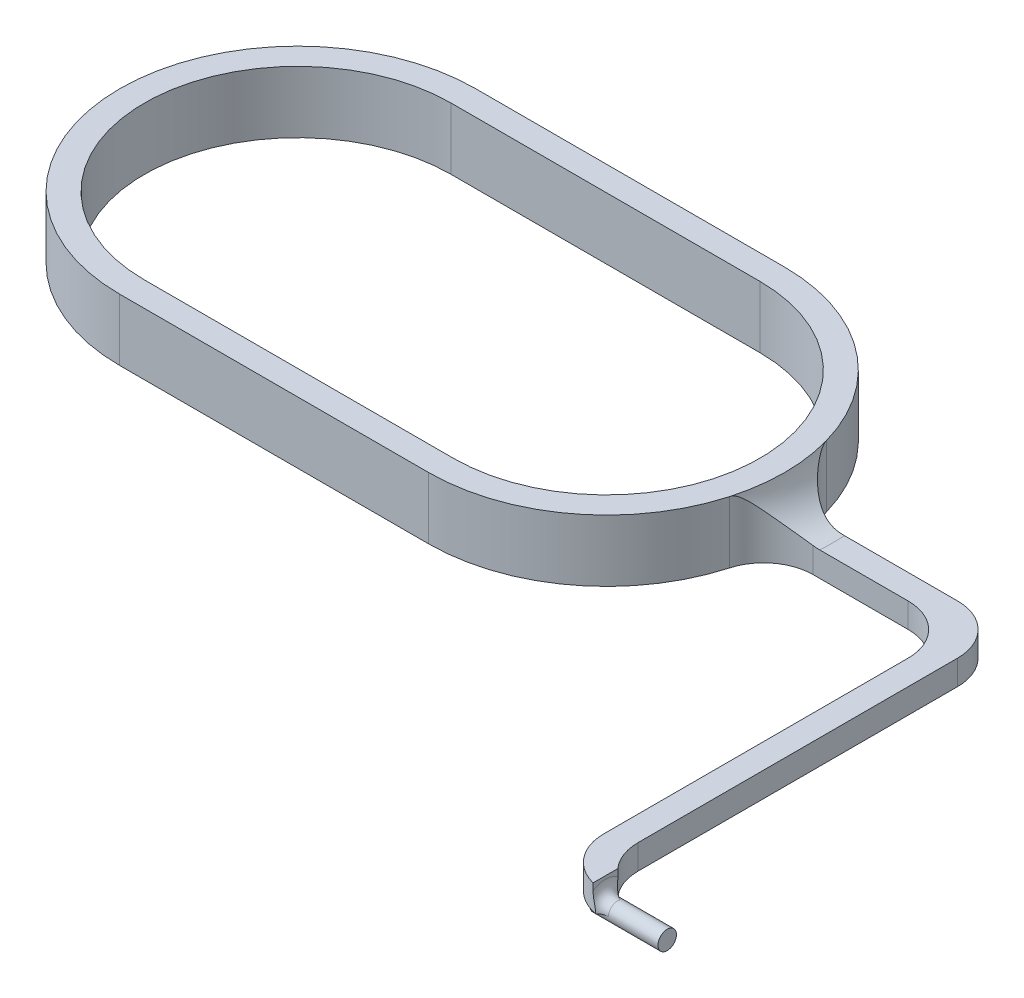
ISO-10303-21;
HEADER;
FILE_DESCRIPTION(('STEP AP214'),'2;1');
FILE_NAME('part.step','',(''),(''),'','','');
FILE_SCHEMA(('AUTOMOTIVE_DESIGN { 1 0 10303 214 1 1 1 1 }'));
ENDSEC;
DATA;
#1=APPLICATION_CONTEXT('core data for automotive mechanical design processes');
#2=APPLICATION_PROTOCOL_DEFINITION('international standard','automotive_design',2000,#1);
#3=PRODUCT_CONTEXT('',#1,'mechanical');
#4=PRODUCT('Part','Part','',(#3));
#5=PRODUCT_RELATED_PRODUCT_CATEGORY('part','',(#4));
#6=PRODUCT_DEFINITION_FORMATION('','',#4);
#7=PRODUCT_DEFINITION_CONTEXT('part definition',#1,'design');
#8=PRODUCT_DEFINITION('design','',#6,#7);
#9=PRODUCT_DEFINITION_SHAPE('','',#8);
#10=(LENGTH_UNIT() NAMED_UNIT(*) SI_UNIT(.MILLI.,.METRE.));
#11=(NAMED_UNIT(*) PLANE_ANGLE_UNIT() SI_UNIT($,.RADIAN.));
#12=(NAMED_UNIT(*) SI_UNIT($,.STERADIAN.) SOLID_ANGLE_UNIT());
#13=UNCERTAINTY_MEASURE_WITH_UNIT(LENGTH_MEASURE(1.E-05),#10,'distance_accuracy_value','');
#14=(GEOMETRIC_REPRESENTATION_CONTEXT(3) GLOBAL_UNCERTAINTY_ASSIGNED_CONTEXT((#13)) GLOBAL_UNIT_ASSIGNED_CONTEXT((#10,
#11,#12)) REPRESENTATION_CONTEXT('',''));
#15=CARTESIAN_POINT('',(0.,0.,0.));
#16=DIRECTION('',(0.,0.,1.));
#17=DIRECTION('',(1.,0.,0.));
#18=AXIS2_PLACEMENT_3D('',#15,#16,#17);
#19=CARTESIAN_POINT('',(25.,5.,0.));
#20=DIRECTION('',(0.,-1.,0.));
#21=DIRECTION('',(0.,0.,-1.));
#22=AXIS2_PLACEMENT_3D('',#19,#20,#21);
#23=CYLINDRICAL_SURFACE('',#22,14.4);
#24=CARTESIAN_POINT('',(25.,0.,0.));
#25=DIRECTION('',(0.,1.,0.));
#26=DIRECTION('',(0.,0.,1.));
#27=AXIS2_PLACEMENT_3D('',#24,#25,#26);
#28=CIRCLE('',#27,14.4);
#29=CARTESIAN_POINT('',(25.,0.,14.4));
#30=VERTEX_POINT('',#29);
#31=CARTESIAN_POINT('',(38.8581416769075,0.,3.91304347826087));
#32=VERTEX_POINT('',#31);
#33=EDGE_CURVE('E347',#30,#32,#28,.T.);
#34=ORIENTED_EDGE('',*,*,#33,.T.);
#35=DIRECTION('',(0.,-1.,0.));
#36=VECTOR('',#35,1.);
#37=CARTESIAN_POINT('',(38.8581416769075,5.,3.91304347826087));
#38=LINE('',#37,#36);
#39=CARTESIAN_POINT('',(38.8581416769075,5.,3.91304347826087));
#40=VERTEX_POINT('',#39);
#41=EDGE_CURVE('E381',#32,#40,#38,.F.);
#42=ORIENTED_EDGE('',*,*,#41,.T.);
#43=CARTESIAN_POINT('',(25.,5.,0.));
#44=DIRECTION('',(0.,1.,0.));
#45=DIRECTION('',(0.,0.,1.));
#46=AXIS2_PLACEMENT_3D('',#43,#44,#45);
#47=CIRCLE('',#46,14.4);
#48=CARTESIAN_POINT('',(25.,5.,14.4));
#49=VERTEX_POINT('',#48);
#50=EDGE_CURVE('E331',#49,#40,#47,.T.);
#51=ORIENTED_EDGE('',*,*,#50,.F.);
#52=DIRECTION('',(0.,-1.,0.));
#53=VECTOR('',#52,1.);
#54=CARTESIAN_POINT('',(25.,5.,14.4));
#55=LINE('',#54,#53);
#56=EDGE_CURVE('E360',#49,#30,#55,.T.);
#57=ORIENTED_EDGE('',*,*,#56,.T.);
#58=EDGE_LOOP('',(#34,#42,#51,#57));
#59=FACE_BOUND('',#58,.T.);
#60=ADVANCED_FACE('F41',(#59),#23,.T.);
#61=CARTESIAN_POINT('',(0.,5.,0.));
#62=DIRECTION('',(0.,1.,0.));
#63=DIRECTION('',(0.,0.,1.));
#64=AXIS2_PLACEMENT_3D('',#61,#62,#63);
#65=PLANE('',#64);
#66=CARTESIAN_POINT('',(0.,5.,0.));
#67=DIRECTION('',(0.,1.,0.));
#68=DIRECTION('',(0.,0.,1.));
#69=AXIS2_PLACEMENT_3D('',#66,#67,#68);
#70=CIRCLE('',#69,14.4);
#71=CARTESIAN_POINT('',(0.,5.,-14.4));
#72=VERTEX_POINT('',#71);
#73=CARTESIAN_POINT('',(0.,5.,14.4));
#74=VERTEX_POINT('',#73);
#75=EDGE_CURVE('E322',#72,#74,#70,.T.);
#76=ORIENTED_EDGE('',*,*,#75,.T.);
#77=DIRECTION('',(1.,0.,0.));
#78=VECTOR('',#77,1.);
#79=CARTESIAN_POINT('',(0.,5.,14.4));
#80=LINE('',#79,#78);
#81=EDGE_CURVE('E326',#74,#49,#80,.T.);
#82=ORIENTED_EDGE('',*,*,#81,.T.);
#83=ORIENTED_EDGE('',*,*,#50,.T.);
#84=CARTESIAN_POINT('',(38.8581416769075,5.,-3.91304347826087));
#85=VERTEX_POINT('',#84);
#86=EDGE_CURVE('E336',#40,#85,#47,.T.);
#87=ORIENTED_EDGE('',*,*,#86,.T.);
#88=CARTESIAN_POINT('',(25.,5.,-14.4));
#89=VERTEX_POINT('',#88);
#90=EDGE_CURVE('E330',#85,#89,#47,.T.);
#91=ORIENTED_EDGE('',*,*,#90,.T.);
#92=DIRECTION('',(-1.,0.,0.));
#93=VECTOR('',#92,1.);
#94=CARTESIAN_POINT('',(0.,5.,-14.4));
#95=LINE('',#94,#93);
#96=EDGE_CURVE('E335',#89,#72,#95,.T.);
#97=ORIENTED_EDGE('',*,*,#96,.T.);
#98=EDGE_LOOP('',(#76,#82,#83,#87,#91,#97));
#99=FACE_BOUND('',#98,.T.);
#100=DIRECTION('',(1.,0.,0.));
#101=VECTOR('',#100,1.);
#102=CARTESIAN_POINT('',(0.,5.,12.4));
#103=LINE('',#102,#101);
#104=CARTESIAN_POINT('',(0.,5.,12.4));
#105=VERTEX_POINT('',#104);
#106=CARTESIAN_POINT('',(25.,5.,12.4));
#107=VERTEX_POINT('',#106);
#108=EDGE_CURVE('E282',#105,#107,#103,.T.);
#109=ORIENTED_EDGE('',*,*,#108,.F.);
#110=CARTESIAN_POINT('',(0.,5.,0.));
#111=DIRECTION('',(0.,1.,0.));
#112=DIRECTION('',(0.,0.,1.));
#113=AXIS2_PLACEMENT_3D('',#110,#111,#112);
#114=CIRCLE('',#113,12.4);
#115=CARTESIAN_POINT('',(0.,5.,-12.4));
#116=VERTEX_POINT('',#115);
#117=EDGE_CURVE('E279',#116,#105,#114,.T.);
#118=ORIENTED_EDGE('',*,*,#117,.F.);
#119=DIRECTION('',(-1.,0.,0.));
#120=VECTOR('',#119,1.);
#121=CARTESIAN_POINT('',(0.,5.,-12.4));
#122=LINE('',#121,#120);
#123=CARTESIAN_POINT('',(25.,5.,-12.4));
#124=VERTEX_POINT('',#123);
#125=EDGE_CURVE('E290',#124,#116,#122,.T.);
#126=ORIENTED_EDGE('',*,*,#125,.F.);
#127=CARTESIAN_POINT('',(25.,5.,0.));
#128=DIRECTION('',(0.,1.,0.));
#129=DIRECTION('',(0.,0.,1.));
#130=AXIS2_PLACEMENT_3D('',#127,#128,#129);
#131=CIRCLE('',#130,12.4);
#132=EDGE_CURVE('E286',#107,#124,#131,.T.);
#133=ORIENTED_EDGE('',*,*,#132,.F.);
#134=EDGE_LOOP('',(#109,#118,#126,#133));
#135=FACE_BOUND('',#134,.T.);
#136=ADVANCED_FACE('F506',(#99,#135),#65,.T.);
#137=CARTESIAN_POINT('',(0.,0.,0.));
#138=DIRECTION('',(0.,1.,0.));
#139=DIRECTION('',(0.,0.,1.));
#140=AXIS2_PLACEMENT_3D('',#137,#138,#139);
#141=PLANE('',#140);
#142=CARTESIAN_POINT('',(25.,0.,0.));
#143=DIRECTION('',(0.,1.,0.));
#144=DIRECTION('',(0.,0.,1.));
#145=AXIS2_PLACEMENT_3D('',#142,#143,#144);
#146=CIRCLE('',#145,12.4);
#147=CARTESIAN_POINT('',(25.,0.,12.4));
#148=VERTEX_POINT('',#147);
#149=CARTESIAN_POINT('',(25.,0.,-12.4));
#150=VERTEX_POINT('',#149);
#151=EDGE_CURVE('E301',#148,#150,#146,.T.);
#152=ORIENTED_EDGE('',*,*,#151,.T.);
#153=DIRECTION('',(-1.,0.,0.));
#154=VECTOR('',#153,1.);
#155=CARTESIAN_POINT('',(0.,0.,-12.4));
#156=LINE('',#155,#154);
#157=CARTESIAN_POINT('',(0.,0.,-12.4));
#158=VERTEX_POINT('',#157);
#159=EDGE_CURVE('E283',#150,#158,#156,.T.);
#160=ORIENTED_EDGE('',*,*,#159,.T.);
#161=CARTESIAN_POINT('',(0.,0.,0.));
#162=DIRECTION('',(0.,1.,0.));
#163=DIRECTION('',(0.,0.,1.));
#164=AXIS2_PLACEMENT_3D('',#161,#162,#163);
#165=CIRCLE('',#164,12.4);
#166=CARTESIAN_POINT('',(0.,0.,12.4));
#167=VERTEX_POINT('',#166);
#168=EDGE_CURVE('E275',#158,#167,#165,.T.);
#169=ORIENTED_EDGE('',*,*,#168,.T.);
#170=DIRECTION('',(1.,0.,0.));
#171=VECTOR('',#170,1.);
#172=CARTESIAN_POINT('',(0.,0.,12.4));
#173=LINE('',#172,#171);
#174=EDGE_CURVE('E297',#167,#148,#173,.T.);
#175=ORIENTED_EDGE('',*,*,#174,.T.);
#176=EDGE_LOOP('',(#152,#160,#169,#175));
#177=FACE_BOUND('',#176,.T.);
#178=DIRECTION('',(0.,0.,-1.));
#179=VECTOR('',#178,1.);
#180=CARTESIAN_POINT('',(56.9,0.,0.));
#181=LINE('',#180,#179);
#182=CARTESIAN_POINT('',(56.9,0.,33.25));
#183=VERTEX_POINT('',#182);
#184=CARTESIAN_POINT('',(56.9,0.,31.75));
#185=VERTEX_POINT('',#184);
#186=EDGE_CURVE('E209',#183,#185,#181,.T.);
#187=ORIENTED_EDGE('',*,*,#186,.F.);
#188=DIRECTION('',(1.,0.,0.));
#189=VECTOR('',#188,1.);
#190=CARTESIAN_POINT('',(56.9,0.,33.25));
#191=LINE('',#190,#189);
#192=CARTESIAN_POINT('',(58.4,0.,33.25));
#193=VERTEX_POINT('',#192);
#194=EDGE_CURVE('E223',#183,#193,#191,.T.);
#195=ORIENTED_EDGE('',*,*,#194,.T.);
#196=CARTESIAN_POINT('',(58.4,0.,34.25));
#197=DIRECTION('',(0.,1.,0.));
#198=DIRECTION('',(0.,0.,1.));
#199=AXIS2_PLACEMENT_3D('',#196,#197,#198);
#200=CIRCLE('',#199,1.);
#201=CARTESIAN_POINT('',(57.675393330706,0.,33.5608373379131));
#202=VERTEX_POINT('',#201);
#203=EDGE_CURVE('E56',#193,#202,#200,.T.);
#204=ORIENTED_EDGE('',*,*,#203,.T.);
#205=CARTESIAN_POINT('',(58.4,0.,29.6270166537926));
#206=DIRECTION('',(0.,1.,0.));
#207=DIRECTION('',(0.,0.,1.));
#208=AXIS2_PLACEMENT_3D('',#205,#206,#207);
#209=CIRCLE('',#208,4.);
#210=CARTESIAN_POINT('',(54.4,0.,29.6270166537926));
#211=VERTEX_POINT('',#210);
#212=EDGE_CURVE('E70',#202,#211,#209,.F.);
#213=ORIENTED_EDGE('',*,*,#212,.T.);
#214=DIRECTION('',(0.,0.,1.));
#215=VECTOR('',#214,1.);
#216=CARTESIAN_POINT('',(54.4,0.,0.));
#217=LINE('',#216,#215);
#218=CARTESIAN_POINT('',(54.4,0.,5.));
#219=VERTEX_POINT('',#218);
#220=EDGE_CURVE('E256',#219,#211,#217,.T.);
#221=ORIENTED_EDGE('',*,*,#220,.F.);
#222=CARTESIAN_POINT('',(50.4,0.,5.));
#223=DIRECTION('',(0.,1.,0.));
#224=DIRECTION('',(0.,0.,1.));
#225=AXIS2_PLACEMENT_3D('',#222,#223,#224);
#226=CIRCLE('',#225,4.);
#227=CARTESIAN_POINT('',(50.4,0.,1.));
#228=VERTEX_POINT('',#227);
#229=EDGE_CURVE('E557',#219,#228,#226,.T.);
#230=ORIENTED_EDGE('',*,*,#229,.T.);
#231=DIRECTION('',(1.,0.,0.));
#232=VECTOR('',#231,1.);
#233=CARTESIAN_POINT('',(0.,0.,1.));
#234=LINE('',#233,#232);
#235=CARTESIAN_POINT('',(42.7076254760484,0.,1.));
#236=VERTEX_POINT('',#235);
#237=EDGE_CURVE('E260',#236,#228,#234,.T.);
#238=ORIENTED_EDGE('',*,*,#237,.F.);
#239=CARTESIAN_POINT('',(42.7076254760484,0.,5.));
#240=DIRECTION('',(0.,1.,0.));
#241=DIRECTION('',(0.,0.,1.));
#242=AXIS2_PLACEMENT_3D('',#239,#240,#241);
#243=CIRCLE('',#242,4.);
#244=EDGE_CURVE('E551',#236,#32,#243,.T.);
#245=ORIENTED_EDGE('',*,*,#244,.T.);
#246=ORIENTED_EDGE('',*,*,#33,.F.);
#247=DIRECTION('',(1.,0.,0.));
#248=VECTOR('',#247,1.);
#249=CARTESIAN_POINT('',(0.,0.,14.4));
#250=LINE('',#249,#248);
#251=CARTESIAN_POINT('',(0.,0.,14.4));
#252=VERTEX_POINT('',#251);
#253=EDGE_CURVE('E343',#252,#30,#250,.T.);
#254=ORIENTED_EDGE('',*,*,#253,.F.);
#255=CARTESIAN_POINT('',(0.,0.,0.));
#256=DIRECTION('',(0.,1.,0.));
#257=DIRECTION('',(0.,0.,1.));
#258=AXIS2_PLACEMENT_3D('',#255,#256,#257);
#259=CIRCLE('',#258,14.4);
#260=CARTESIAN_POINT('',(0.,0.,-14.4));
#261=VERTEX_POINT('',#260);
#262=EDGE_CURVE('E321',#261,#252,#259,.T.);
#263=ORIENTED_EDGE('',*,*,#262,.F.);
#264=DIRECTION('',(-1.,0.,0.));
#265=VECTOR('',#264,1.);
#266=CARTESIAN_POINT('',(0.,0.,-14.4));
#267=LINE('',#266,#265);
#268=CARTESIAN_POINT('',(25.,0.,-14.4));
#269=VERTEX_POINT('',#268);
#270=EDGE_CURVE('E327',#269,#261,#267,.T.);
#271=ORIENTED_EDGE('',*,*,#270,.F.);
#272=CARTESIAN_POINT('',(38.8581416769075,0.,-3.91304347826087));
#273=VERTEX_POINT('',#272);
#274=EDGE_CURVE('E346',#273,#269,#28,.T.);
#275=ORIENTED_EDGE('',*,*,#274,.F.);
#276=CARTESIAN_POINT('',(42.7076254760484,0.,-5.));
#277=DIRECTION('',(0.,1.,0.));
#278=DIRECTION('',(0.,0.,1.));
#279=AXIS2_PLACEMENT_3D('',#276,#277,#278);
#280=CIRCLE('',#279,4.);
#281=CARTESIAN_POINT('',(42.7076254760484,0.,-1.));
#282=VERTEX_POINT('',#281);
#283=EDGE_CURVE('E546',#273,#282,#280,.T.);
#284=ORIENTED_EDGE('',*,*,#283,.T.);
#285=DIRECTION('',(1.,0.,0.));
#286=VECTOR('',#285,1.);
#287=CARTESIAN_POINT('',(0.,0.,-1.));
#288=LINE('',#287,#286);
#289=CARTESIAN_POINT('',(52.4,0.,-1.));
#290=VERTEX_POINT('',#289);
#291=EDGE_CURVE('E265',#282,#290,#288,.T.);
#292=ORIENTED_EDGE('',*,*,#291,.T.);
#293=CARTESIAN_POINT('',(52.4,0.,3.));
#294=DIRECTION('',(0.,1.,0.));
#295=DIRECTION('',(0.,0.,1.));
#296=AXIS2_PLACEMENT_3D('',#293,#294,#295);
#297=CIRCLE('',#296,4.);
#298=CARTESIAN_POINT('',(56.4,0.,3.));
#299=VERTEX_POINT('',#298);
#300=EDGE_CURVE('E399',#290,#299,#297,.F.);
#301=ORIENTED_EDGE('',*,*,#300,.T.);
#302=DIRECTION('',(0.,0.,1.));
#303=VECTOR('',#302,1.);
#304=CARTESIAN_POINT('',(56.4,0.,0.));
#305=LINE('',#304,#303);
#306=CARTESIAN_POINT('',(56.4,0.,28.8542486889354));
#307=VERTEX_POINT('',#306);
#308=EDGE_CURVE('E239',#299,#307,#305,.T.);
#309=ORIENTED_EDGE('',*,*,#308,.T.);
#310=CARTESIAN_POINT('',(60.4,0.,28.8542486889354));
#311=DIRECTION('',(0.,1.,0.));
#312=DIRECTION('',(0.,0.,1.));
#313=AXIS2_PLACEMENT_3D('',#310,#311,#312);
#314=CIRCLE('',#313,4.);
#315=CARTESIAN_POINT('',(57.6405391206854,0.,31.75));
#316=VERTEX_POINT('',#315);
#317=EDGE_CURVE('E63',#307,#316,#314,.T.);
#318=ORIENTED_EDGE('',*,*,#317,.T.);
#319=DIRECTION('',(1.,0.,0.));
#320=VECTOR('',#319,1.);
#321=CARTESIAN_POINT('',(56.9,0.,31.75));
#322=LINE('',#321,#320);
#323=EDGE_CURVE('E220',#316,#185,#322,.F.);
#324=ORIENTED_EDGE('',*,*,#323,.T.);
#325=EDGE_LOOP('',(#187,#195,#204,#213,#221,#230,#238,#245,#246,#254,#263,#271,#275,#284,#292,
#301,#309,#318,#324));
#326=FACE_BOUND('',#325,.T.);
#327=ADVANCED_FACE('F227',(#177,#326),#141,.F.);
#328=CARTESIAN_POINT('',(0.,5.,0.));
#329=DIRECTION('',(0.,-1.,0.));
#330=DIRECTION('',(0.,0.,-1.));
#331=AXIS2_PLACEMENT_3D('',#328,#329,#330);
#332=CYLINDRICAL_SURFACE('',#331,14.4);
#333=ORIENTED_EDGE('',*,*,#262,.T.);
#334=DIRECTION('',(0.,-1.,0.));
#335=VECTOR('',#334,1.);
#336=CARTESIAN_POINT('',(0.,5.,14.4));
#337=LINE('',#336,#335);
#338=EDGE_CURVE('E364',#74,#252,#337,.T.);
#339=ORIENTED_EDGE('',*,*,#338,.F.);
#340=ORIENTED_EDGE('',*,*,#75,.F.);
#341=DIRECTION('',(0.,-1.,0.));
#342=VECTOR('',#341,1.);
#343=CARTESIAN_POINT('',(0.,5.,-14.4));
#344=LINE('',#343,#342);
#345=EDGE_CURVE('E339',#72,#261,#344,.T.);
#346=ORIENTED_EDGE('',*,*,#345,.T.);
#347=EDGE_LOOP('',(#333,#339,#340,#346));
#348=FACE_BOUND('',#347,.T.);
#349=ADVANCED_FACE('F527',(#348),#332,.T.);
#350=CARTESIAN_POINT('',(0.,5.,14.4));
#351=DIRECTION('',(0.,0.,-1.));
#352=DIRECTION('',(-1.,0.,0.));
#353=AXIS2_PLACEMENT_3D('',#350,#351,#352);
#354=PLANE('',#353);
#355=ORIENTED_EDGE('',*,*,#253,.T.);
#356=ORIENTED_EDGE('',*,*,#56,.F.);
#357=ORIENTED_EDGE('',*,*,#81,.F.);
#358=ORIENTED_EDGE('',*,*,#338,.T.);
#359=EDGE_LOOP('',(#355,#356,#357,#358));
#360=FACE_BOUND('',#359,.T.);
#361=ADVANCED_FACE('F519',(#360),#354,.F.);
#362=ORIENTED_EDGE('',*,*,#90,.F.);
#363=DIRECTION('',(0.,-1.,0.));
#364=VECTOR('',#363,1.);
#365=CARTESIAN_POINT('',(38.8581416769075,5.,-3.91304347826087));
#366=LINE('',#365,#364);
#367=EDGE_CURVE('E378',#85,#273,#366,.T.);
#368=ORIENTED_EDGE('',*,*,#367,.T.);
#369=ORIENTED_EDGE('',*,*,#274,.T.);
#370=DIRECTION('',(0.,-1.,0.));
#371=VECTOR('',#370,1.);
#372=CARTESIAN_POINT('',(25.,5.,-14.4));
#373=LINE('',#372,#371);
#374=EDGE_CURVE('E356',#89,#269,#373,.T.);
#375=ORIENTED_EDGE('',*,*,#374,.F.);
#376=EDGE_LOOP('',(#362,#368,#369,#375));
#377=FACE_BOUND('',#376,.T.);
#378=ADVANCED_FACE('F509',(#377),#23,.T.);
#379=CARTESIAN_POINT('',(0.,5.,-14.4));
#380=DIRECTION('',(0.,0.,1.));
#381=DIRECTION('',(1.,0.,0.));
#382=AXIS2_PLACEMENT_3D('',#379,#380,#381);
#383=PLANE('',#382);
#384=ORIENTED_EDGE('',*,*,#270,.T.);
#385=ORIENTED_EDGE('',*,*,#345,.F.);
#386=ORIENTED_EDGE('',*,*,#96,.F.);
#387=ORIENTED_EDGE('',*,*,#374,.T.);
#388=EDGE_LOOP('',(#384,#385,#386,#387));
#389=FACE_BOUND('',#388,.T.);
#390=ADVANCED_FACE('F518',(#389),#383,.F.);
#391=CARTESIAN_POINT('',(0.,5.,0.));
#392=DIRECTION('',(0.,-1.,0.));
#393=DIRECTION('',(0.,0.,-1.));
#394=AXIS2_PLACEMENT_3D('',#391,#392,#393);
#395=CYLINDRICAL_SURFACE('',#394,12.4);
#396=ORIENTED_EDGE('',*,*,#168,.F.);
#397=DIRECTION('',(0.,-1.,0.));
#398=VECTOR('',#397,1.);
#399=CARTESIAN_POINT('',(0.,5.,-12.4));
#400=LINE('',#399,#398);
#401=EDGE_CURVE('E293',#116,#158,#400,.T.);
#402=ORIENTED_EDGE('',*,*,#401,.F.);
#403=ORIENTED_EDGE('',*,*,#117,.T.);
#404=DIRECTION('',(0.,-1.,0.));
#405=VECTOR('',#404,1.);
#406=CARTESIAN_POINT('',(0.,5.,12.4));
#407=LINE('',#406,#405);
#408=EDGE_CURVE('E317',#105,#167,#407,.T.);
#409=ORIENTED_EDGE('',*,*,#408,.T.);
#410=EDGE_LOOP('',(#396,#402,#403,#409));
#411=FACE_BOUND('',#410,.T.);
#412=ADVANCED_FACE('F525',(#411),#395,.F.);
#413=CARTESIAN_POINT('',(0.,5.,12.4));
#414=DIRECTION('',(0.,0.,-1.));
#415=DIRECTION('',(-1.,0.,0.));
#416=AXIS2_PLACEMENT_3D('',#413,#414,#415);
#417=PLANE('',#416);
#418=ORIENTED_EDGE('',*,*,#174,.F.);
#419=ORIENTED_EDGE('',*,*,#408,.F.);
#420=ORIENTED_EDGE('',*,*,#108,.T.);
#421=DIRECTION('',(0.,-1.,0.));
#422=VECTOR('',#421,1.);
#423=CARTESIAN_POINT('',(25.,5.,12.4));
#424=LINE('',#423,#422);
#425=EDGE_CURVE('E314',#107,#148,#424,.T.);
#426=ORIENTED_EDGE('',*,*,#425,.T.);
#427=EDGE_LOOP('',(#418,#419,#420,#426));
#428=FACE_BOUND('',#427,.T.);
#429=ADVANCED_FACE('F611',(#428),#417,.T.);
#430=CARTESIAN_POINT('',(25.,5.,0.));
#431=DIRECTION('',(0.,-1.,0.));
#432=DIRECTION('',(0.,0.,-1.));
#433=AXIS2_PLACEMENT_3D('',#430,#431,#432);
#434=CYLINDRICAL_SURFACE('',#433,12.4);
#435=DIRECTION('',(0.,-1.,0.));
#436=VECTOR('',#435,1.);
#437=CARTESIAN_POINT('',(25.,5.,-12.4));
#438=LINE('',#437,#436);
#439=EDGE_CURVE('E310',#124,#150,#438,.T.);
#440=ORIENTED_EDGE('',*,*,#439,.T.);
#441=ORIENTED_EDGE('',*,*,#151,.F.);
#442=ORIENTED_EDGE('',*,*,#425,.F.);
#443=ORIENTED_EDGE('',*,*,#132,.T.);
#444=EDGE_LOOP('',(#440,#441,#442,#443));
#445=FACE_BOUND('',#444,.T.);
#446=ADVANCED_FACE('F607',(#445),#434,.F.);
#447=CARTESIAN_POINT('',(0.,5.,-12.4));
#448=DIRECTION('',(0.,0.,1.));
#449=DIRECTION('',(1.,0.,0.));
#450=AXIS2_PLACEMENT_3D('',#447,#448,#449);
#451=PLANE('',#450);
#452=ORIENTED_EDGE('',*,*,#159,.F.);
#453=ORIENTED_EDGE('',*,*,#439,.F.);
#454=ORIENTED_EDGE('',*,*,#125,.T.);
#455=ORIENTED_EDGE('',*,*,#401,.T.);
#456=EDGE_LOOP('',(#452,#453,#454,#455));
#457=FACE_BOUND('',#456,.T.);
#458=ADVANCED_FACE('F604',(#457),#451,.T.);
#459=CARTESIAN_POINT('',(0.,2.,-1.));
#460=DIRECTION('',(0.,0.,-1.));
#461=DIRECTION('',(-1.,0.,0.));
#462=AXIS2_PLACEMENT_3D('',#459,#460,#461);
#463=PLANE('',#462);
#464=ORIENTED_EDGE('',*,*,#291,.F.);
#465=DIRECTION('',(0.,-1.,0.));
#466=VECTOR('',#465,1.);
#467=CARTESIAN_POINT('',(42.7076254760484,2.,-1.));
#468=LINE('',#467,#466);
#469=CARTESIAN_POINT('',(42.7076254760484,2.03622952170572,-1.));
#470=VERTEX_POINT('',#469);
#471=EDGE_CURVE('E394',#282,#470,#468,.F.);
#472=ORIENTED_EDGE('',*,*,#471,.T.);
#473=CARTESIAN_POINT('',(42.7076254760484,2.03622952170572,-1.));
#474=CARTESIAN_POINT('',(42.7968817290654,2.02416006023484,-1.));
#475=CARTESIAN_POINT('',(42.886341065835,2.01510620269078,-1.));
#476=CARTESIAN_POINT('',(43.0656659163424,2.00302969481902,-1.));
#477=CARTESIAN_POINT('',(43.1555314301229,2.00000704512784,-1.));
#478=CARTESIAN_POINT('',(43.2456000276991,1.99999999999998,-1.));
#479=B_SPLINE_CURVE_WITH_KNOTS('',3,(#473,#474,#475,#476,#477,#478),.UNSPECIFIED.,.F.,.F.,(4,2,
4),(0.,0.269748971166196,0.53949797080073),.UNSPECIFIED.);
#480=CARTESIAN_POINT('',(43.2456000276991,2.,-1.));
#481=VERTEX_POINT('',#480);
#482=EDGE_CURVE('E426',#470,#481,#479,.T.);
#483=ORIENTED_EDGE('',*,*,#482,.T.);
#484=DIRECTION('',(1.,0.,0.));
#485=VECTOR('',#484,1.);
#486=CARTESIAN_POINT('',(0.,2.,-1.));
#487=LINE('',#486,#485);
#488=CARTESIAN_POINT('',(52.4,2.,-1.));
#489=VERTEX_POINT('',#488);
#490=EDGE_CURVE('E247',#481,#489,#487,.T.);
#491=ORIENTED_EDGE('',*,*,#490,.T.);
#492=DIRECTION('',(0.,-1.,0.));
#493=VECTOR('',#492,1.);
#494=CARTESIAN_POINT('',(52.4,2.,-1.));
#495=LINE('',#494,#493);
#496=EDGE_CURVE('E390',#489,#290,#495,.T.);
#497=ORIENTED_EDGE('',*,*,#496,.T.);
#498=EDGE_LOOP('',(#464,#472,#483,#491,#497));
#499=FACE_BOUND('',#498,.T.);
#500=ADVANCED_FACE('F601',(#499),#463,.T.);
#501=CARTESIAN_POINT('',(0.,2.,1.));
#502=DIRECTION('',(0.,0.,-1.));
#503=DIRECTION('',(-1.,0.,0.));
#504=AXIS2_PLACEMENT_3D('',#501,#502,#503);
#505=PLANE('',#504);
#506=CARTESIAN_POINT('',(43.2456000276991,2.,1.));
#507=CARTESIAN_POINT('',(43.1555314301229,2.00000704512785,1.));
#508=CARTESIAN_POINT('',(43.0656659163424,2.00302969481903,1.));
#509=CARTESIAN_POINT('',(42.886341065835,2.01510620269078,1.));
#510=CARTESIAN_POINT('',(42.7968817290654,2.02416006023484,1.));
#511=CARTESIAN_POINT('',(42.7076254760484,2.03622952170572,1.));
#512=B_SPLINE_CURVE_WITH_KNOTS('',3,(#506,#507,#508,#509,#510,#511),.UNSPECIFIED.,.F.,.F.,(4,2,
4),(0.,0.269748999634534,0.53949797080073),.UNSPECIFIED.);
#513=CARTESIAN_POINT('',(43.2456000276991,2.,1.));
#514=VERTEX_POINT('',#513);
#515=CARTESIAN_POINT('',(42.7076254760484,2.03622952170572,1.));
#516=VERTEX_POINT('',#515);
#517=EDGE_CURVE('E416',#514,#516,#512,.T.);
#518=ORIENTED_EDGE('',*,*,#517,.T.);
#519=DIRECTION('',(0.,1.,0.));
#520=VECTOR('',#519,1.);
#521=CARTESIAN_POINT('',(42.7076254760484,0.,1.));
#522=LINE('',#521,#520);
#523=EDGE_CURVE('E387',#516,#236,#522,.F.);
#524=ORIENTED_EDGE('',*,*,#523,.T.);
#525=ORIENTED_EDGE('',*,*,#237,.T.);
#526=DIRECTION('',(0.,-1.,0.));
#527=VECTOR('',#526,1.);
#528=CARTESIAN_POINT('',(50.4,2.,1.));
#529=LINE('',#528,#527);
#530=CARTESIAN_POINT('',(50.4,2.,1.));
#531=VERTEX_POINT('',#530);
#532=EDGE_CURVE('E384',#228,#531,#529,.F.);
#533=ORIENTED_EDGE('',*,*,#532,.T.);
#534=DIRECTION('',(1.,0.,0.));
#535=VECTOR('',#534,1.);
#536=CARTESIAN_POINT('',(0.,2.,1.));
#537=LINE('',#536,#535);
#538=EDGE_CURVE('E243',#514,#531,#537,.T.);
#539=ORIENTED_EDGE('',*,*,#538,.F.);
#540=EDGE_LOOP('',(#518,#524,#525,#533,#539));
#541=FACE_BOUND('',#540,.T.);
#542=ADVANCED_FACE('F433',(#541),#505,.F.);
#543=CARTESIAN_POINT('',(57.4,2.,0.));
#544=DIRECTION('',(-1.,0.,0.));
#545=DIRECTION('',(0.,0.,1.));
#546=AXIS2_PLACEMENT_3D('',#543,#544,#545);
#547=PLANE('',#546);
#548=DIRECTION('',(0.,-1.,0.));
#549=VECTOR('',#548,1.);
#550=CARTESIAN_POINT('',(57.4,2.,33.5));
#551=LINE('',#550,#549);
#552=CARTESIAN_POINT('',(57.4,2.,33.5));
#553=VERTEX_POINT('',#552);
#554=CARTESIAN_POINT('',(57.4,1.4361406616345,33.5));
#555=VERTEX_POINT('',#554);
#556=EDGE_CURVE('E255',#553,#555,#551,.T.);
#557=ORIENTED_EDGE('',*,*,#556,.T.);
#558=CARTESIAN_POINT('',(57.4,0.,32.5));
#559=DIRECTION('',(-1.,0.,0.));
#560=DIRECTION('',(0.,0.,1.));
#561=AXIS2_PLACEMENT_3D('',#558,#559,#560);
#562=CIRCLE('',#561,1.75);
#563=CARTESIAN_POINT('',(57.4,1.4361406616345,31.5));
#564=VERTEX_POINT('',#563);
#565=EDGE_CURVE('E214',#555,#564,#562,.T.);
#566=ORIENTED_EDGE('',*,*,#565,.T.);
#567=DIRECTION('',(0.,-1.,0.));
#568=VECTOR('',#567,1.);
#569=CARTESIAN_POINT('',(57.4,2.,31.5));
#570=LINE('',#569,#568);
#571=CARTESIAN_POINT('',(57.4,2.,31.5));
#572=VERTEX_POINT('',#571);
#573=EDGE_CURVE('E271',#572,#564,#570,.T.);
#574=ORIENTED_EDGE('',*,*,#573,.F.);
#575=DIRECTION('',(0.,0.,-1.));
#576=VECTOR('',#575,1.);
#577=CARTESIAN_POINT('',(57.4,2.,0.));
#578=LINE('',#577,#576);
#579=EDGE_CURVE('E235',#553,#572,#578,.T.);
#580=ORIENTED_EDGE('',*,*,#579,.F.);
#581=EDGE_LOOP('',(#557,#566,#574,#580));
#582=FACE_BOUND('',#581,.T.);
#583=ADVANCED_FACE('F593',(#582),#547,.F.);
#584=CARTESIAN_POINT('',(56.4,2.,0.));
#585=DIRECTION('',(1.,0.,0.));
#586=DIRECTION('',(0.,0.,-1.));
#587=AXIS2_PLACEMENT_3D('',#584,#585,#586);
#588=PLANE('',#587);
#589=ORIENTED_EDGE('',*,*,#308,.F.);
#590=DIRECTION('',(0.,-1.,0.));
#591=VECTOR('',#590,1.);
#592=CARTESIAN_POINT('',(56.4,2.,3.));
#593=LINE('',#592,#591);
#594=CARTESIAN_POINT('',(56.4,2.,3.));
#595=VERTEX_POINT('',#594);
#596=EDGE_CURVE('E406',#299,#595,#593,.F.);
#597=ORIENTED_EDGE('',*,*,#596,.T.);
#598=DIRECTION('',(0.,0.,1.));
#599=VECTOR('',#598,1.);
#600=CARTESIAN_POINT('',(56.4,2.,0.));
#601=LINE('',#600,#599);
#602=CARTESIAN_POINT('',(56.4,2.,28.8542486889354));
#603=VERTEX_POINT('',#602);
#604=EDGE_CURVE('E251',#595,#603,#601,.T.);
#605=ORIENTED_EDGE('',*,*,#604,.T.);
#606=DIRECTION('',(0.,-1.,0.));
#607=VECTOR('',#606,1.);
#608=CARTESIAN_POINT('',(56.4,0.,28.8542486889354));
#609=LINE('',#608,#607);
#610=EDGE_CURVE('E402',#603,#307,#609,.T.);
#611=ORIENTED_EDGE('',*,*,#610,.T.);
#612=EDGE_LOOP('',(#589,#597,#605,#611));
#613=FACE_BOUND('',#612,.T.);
#614=ADVANCED_FACE('F576',(#613),#588,.T.);
#615=CARTESIAN_POINT('',(54.4,2.,0.));
#616=DIRECTION('',(1.,0.,0.));
#617=DIRECTION('',(0.,0.,-1.));
#618=AXIS2_PLACEMENT_3D('',#615,#616,#617);
#619=PLANE('',#618);
#620=DIRECTION('',(0.,0.,1.));
#621=VECTOR('',#620,1.);
#622=CARTESIAN_POINT('',(54.4,2.,0.));
#623=LINE('',#622,#621);
#624=CARTESIAN_POINT('',(54.4,2.,5.));
#625=VERTEX_POINT('',#624);
#626=CARTESIAN_POINT('',(54.4,2.,29.6270166537926));
#627=VERTEX_POINT('',#626);
#628=EDGE_CURVE('E238',#625,#627,#623,.T.);
#629=ORIENTED_EDGE('',*,*,#628,.F.);
#630=DIRECTION('',(0.,-1.,0.));
#631=VECTOR('',#630,1.);
#632=CARTESIAN_POINT('',(54.4,0.,5.));
#633=LINE('',#632,#631);
#634=EDGE_CURVE('E412',#625,#219,#633,.T.);
#635=ORIENTED_EDGE('',*,*,#634,.T.);
#636=ORIENTED_EDGE('',*,*,#220,.T.);
#637=DIRECTION('',(0.,1.,0.));
#638=VECTOR('',#637,1.);
#639=CARTESIAN_POINT('',(54.4,2.,29.6270166537926));
#640=LINE('',#639,#638);
#641=EDGE_CURVE('E409',#211,#627,#640,.T.);
#642=ORIENTED_EDGE('',*,*,#641,.T.);
#643=EDGE_LOOP('',(#629,#635,#636,#642));
#644=FACE_BOUND('',#643,.T.);
#645=ADVANCED_FACE('F588',(#644),#619,.F.);
#646=CARTESIAN_POINT('',(0.,2.,0.));
#647=DIRECTION('',(0.,-1.,0.));
#648=DIRECTION('',(0.,0.,-1.));
#649=AXIS2_PLACEMENT_3D('',#646,#647,#648);
#650=PLANE('',#649);
#651=ORIENTED_EDGE('',*,*,#490,.F.);
#652=CARTESIAN_POINT('',(25.,2.,0.));
#653=DIRECTION('',(0.,-1.,0.));
#654=DIRECTION('',(0.,0.,-1.));
#655=AXIS2_PLACEMENT_3D('',#652,#653,#654);
#656=CIRCLE('',#655,18.2729833462074);
#657=EDGE_CURVE('E374',#481,#514,#656,.T.);
#658=ORIENTED_EDGE('',*,*,#657,.T.);
#659=ORIENTED_EDGE('',*,*,#538,.T.);
#660=CARTESIAN_POINT('',(50.4,2.,5.));
#661=DIRECTION('',(0.,-1.,0.));
#662=DIRECTION('',(0.,0.,-1.));
#663=AXIS2_PLACEMENT_3D('',#660,#661,#662);
#664=CIRCLE('',#663,4.);
#665=EDGE_CURVE('E562',#531,#625,#664,.T.);
#666=ORIENTED_EDGE('',*,*,#665,.T.);
#667=ORIENTED_EDGE('',*,*,#628,.T.);
#668=CARTESIAN_POINT('',(58.4,2.,29.6270166537926));
#669=DIRECTION('',(0.,-1.,0.));
#670=DIRECTION('',(0.,0.,-1.));
#671=AXIS2_PLACEMENT_3D('',#668,#669,#670);
#672=CIRCLE('',#671,4.);
#673=EDGE_CURVE('E368',#627,#553,#672,.F.);
#674=ORIENTED_EDGE('',*,*,#673,.T.);
#675=ORIENTED_EDGE('',*,*,#579,.T.);
#676=CARTESIAN_POINT('',(60.4,2.,28.8542486889354));
#677=DIRECTION('',(0.,-1.,0.));
#678=DIRECTION('',(0.,0.,-1.));
#679=AXIS2_PLACEMENT_3D('',#676,#677,#678);
#680=CIRCLE('',#679,4.);
#681=EDGE_CURVE('E215',#572,#603,#680,.T.);
#682=ORIENTED_EDGE('',*,*,#681,.T.);
#683=ORIENTED_EDGE('',*,*,#604,.F.);
#684=CARTESIAN_POINT('',(52.4,2.,3.));
#685=DIRECTION('',(0.,-1.,0.));
#686=DIRECTION('',(0.,0.,-1.));
#687=AXIS2_PLACEMENT_3D('',#684,#685,#686);
#688=CIRCLE('',#687,4.);
#689=EDGE_CURVE('E371',#595,#489,#688,.F.);
#690=ORIENTED_EDGE('',*,*,#689,.T.);
#691=EDGE_LOOP('',(#651,#658,#659,#666,#667,#674,#675,#682,#683,#690));
#692=FACE_BOUND('',#691,.T.);
#693=ADVANCED_FACE('F570',(#692),#650,.F.);
#694=CARTESIAN_POINT('',(42.7076254760484,5.,-5.));
#695=DIRECTION('',(0.,-1.,0.));
#696=DIRECTION('',(0.,0.,-1.));
#697=AXIS2_PLACEMENT_3D('',#694,#695,#696);
#698=CYLINDRICAL_SURFACE('',#697,4.);
#699=ORIENTED_EDGE('',*,*,#283,.F.);
#700=ORIENTED_EDGE('',*,*,#367,.F.);
#701=CARTESIAN_POINT('',(38.8581416769075,5.,-3.91304347826087));
#702=CARTESIAN_POINT('',(38.8737938876321,5.00029425951847,-3.85749041928666));
#703=CARTESIAN_POINT('',(38.8905485156222,4.99381203339877,-3.80285822462944));
#704=CARTESIAN_POINT('',(38.9252196071237,4.97066898880633,-3.69756857155877));
#705=CARTESIAN_POINT('',(38.9430994817074,4.95425112477817,-3.64684785363683));
#706=CARTESIAN_POINT('',(38.9914064076107,4.901670685179,-3.51772731990998));
#707=CARTESIAN_POINT('',(39.022597364865,4.85958965638872,-3.44218121836608));
#708=CARTESIAN_POINT('',(39.0873412640276,4.76581604509514,-3.2970806997515));
#709=CARTESIAN_POINT('',(39.1209231291292,4.71398574555848,-3.22763615023572));
#710=CARTESIAN_POINT('',(39.1872189518468,4.61046921836481,-3.09961944736789));
#711=CARTESIAN_POINT('',(39.2197470587856,4.55917554585347,-3.04062889337522));
#712=CARTESIAN_POINT('',(39.2868302646084,4.45448081708104,-2.92573395317279));
#713=CARTESIAN_POINT('',(39.3213863074125,4.4010787833109,-2.86983102800535));
#714=CARTESIAN_POINT('',(39.4284640442125,4.23917439902753,-2.70560391194932));
#715=CARTESIAN_POINT('',(39.5043012374718,4.12912995278307,-2.6009407208296));
#716=CARTESIAN_POINT('',(39.6656328024986,3.90981772996607,-2.39945757162486));
#717=CARTESIAN_POINT('',(39.7510957466309,3.80054859677178,-2.30261376520742));
#718=CARTESIAN_POINT('',(39.9327239069249,3.58502540725307,-2.11610544209169));
#719=CARTESIAN_POINT('',(40.028877155929,3.47876814332025,-2.02643308699724));
#720=CARTESIAN_POINT('',(40.2051398481632,3.29945725419036,-1.87798369542264));
#721=CARTESIAN_POINT('',(40.2825309220137,3.22521222715866,-1.81742193837482));
#722=CARTESIAN_POINT('',(40.4437431771096,3.08025895799115,-1.70079620169586));
#723=CARTESIAN_POINT('',(40.5275654907623,3.00955134235748,-1.6447330177415));
#724=CARTESIAN_POINT('',(40.7888545414628,2.80425434765788,-1.4843162260821));
#725=CARTESIAN_POINT('',(40.976463519028,2.67615508131571,-1.38745891214721));
#726=CARTESIAN_POINT('',(41.3270922758164,2.47545186463794,-1.24229892027352));
#727=CARTESIAN_POINT('',(41.4842132088757,2.39702210636127,-1.18791261636445));
#728=CARTESIAN_POINT('',(41.7294295472946,2.29334628877756,-1.12052630620109));
#729=CARTESIAN_POINT('',(41.8126866193092,2.26113614903262,-1.1004402044304));
#730=CARTESIAN_POINT('',(41.982030251886,2.20180098028814,-1.06541215230009));
#731=CARTESIAN_POINT('',(42.0681156451407,2.17467388364167,-1.05046810821012));
#732=CARTESIAN_POINT('',(42.245362454345,2.12517868961054,-1.02576363679063));
#733=CARTESIAN_POINT('',(42.3365983727148,2.10298692548087,-1.01618085556));
#734=CARTESIAN_POINT('',(42.5209340609593,2.06482626082383,-1.00328343288944));
#735=CARTESIAN_POINT('',(42.6140363905249,2.0488666228228,-0.999978093371043));
#736=CARTESIAN_POINT('',(42.7076254760485,2.03622952170574,-1.));
#737=B_SPLINE_CURVE_WITH_KNOTS('',3,(#701,#702,#703,#704,#705,#706,#707,#708,#709,#710,#711,
#712,#713,#714,#715,#716,#717,#718,#719,#720,#721,#722,#723,#724,#725,#726,#727,#728,#729,#730,
#731,#732,#733,#734,#735,#736),.UNSPECIFIED.,.F.,.F.,(4,2,2,2,2,2,2,2,2,2,2,2,2,2,2,2,2,4),(0.,
0.171852242943848,0.339663044924743,0.613933492801679,0.892417121451976,1.14627476746483,
1.40025152556139,1.90896987853635,2.41607297010184,2.92261399959864,3.291817133777,
3.66108542678682,4.39801662296588,4.94734358143707,5.22156581429318,5.49567625752075,
5.77840031883564,6.06154299516293),.UNSPECIFIED.);
#738=EDGE_CURVE('E261',#470,#85,#737,.F.);
#739=ORIENTED_EDGE('',*,*,#738,.F.);
#740=ORIENTED_EDGE('',*,*,#471,.F.);
#741=EDGE_LOOP('',(#699,#700,#739,#740));
#742=FACE_BOUND('',#741,.T.);
#743=ADVANCED_FACE('F446',(#742),#698,.F.);
#744=CARTESIAN_POINT('',(42.7076254760484,5.,5.));
#745=DIRECTION('',(0.,-1.,0.));
#746=DIRECTION('',(0.,0.,-1.));
#747=AXIS2_PLACEMENT_3D('',#744,#745,#746);
#748=CYLINDRICAL_SURFACE('',#747,4.);
#749=ORIENTED_EDGE('',*,*,#523,.F.);
#750=CARTESIAN_POINT('',(42.7076254760484,2.03622952170572,1.));
#751=CARTESIAN_POINT('',(42.6117296301297,2.04917659243427,0.99997627431075));
#752=CARTESIAN_POINT('',(42.5163486952263,2.06561320735723,1.00344726984538));
#753=CARTESIAN_POINT('',(42.3275515447703,2.10503289723687,1.01698140578546));
#754=CARTESIAN_POINT('',(42.2341328840489,2.12800723320164,1.02703576936773));
#755=CARTESIAN_POINT('',(42.0509554820436,2.17981792275288,1.05319572042867));
#756=CARTESIAN_POINT('',(41.9611676692103,2.20858655151607,1.06923307210432));
#757=CARTESIAN_POINT('',(41.7847451299373,2.27161962569,1.1068733871861));
#758=CARTESIAN_POINT('',(41.698111339913,2.30588568719901,1.12847798835041));
#759=CARTESIAN_POINT('',(41.444574519127,2.41570546907268,1.2006024377427));
#760=CARTESIAN_POINT('',(41.2829040940831,2.49861104976229,1.25860565628762));
#761=CARTESIAN_POINT('',(40.9751066097444,2.67987145793312,1.3907593364351));
#762=CARTESIAN_POINT('',(40.8290378392388,2.77828103926268,1.46496739987747));
#763=CARTESIAN_POINT('',(40.579362326294,2.96652268250551,1.61072174313202));
#764=CARTESIAN_POINT('',(40.4729698838029,3.0544121030053,1.68007732498755));
#765=CARTESIAN_POINT('',(40.2703010505574,3.2358114535735,1.82587904099593));
#766=CARTESIAN_POINT('',(40.1740275327962,3.32932296809924,1.90232717734965));
#767=CARTESIAN_POINT('',(39.9910830845502,3.52027122228204,2.06144664523111));
#768=CARTESIAN_POINT('',(39.9044111547497,3.61770755200934,2.14411732762054));
#769=CARTESIAN_POINT('',(39.7400352695933,3.81483539889961,2.31532176916676));
#770=CARTESIAN_POINT('',(39.6623275930191,3.91452595958766,2.40385307128267));
#771=CARTESIAN_POINT('',(39.5218583744074,4.10507858781602,2.57878260280289));
#772=CARTESIAN_POINT('',(39.4583798919814,4.19591438003411,2.66463562697648));
#773=CARTESIAN_POINT('',(39.337519348466,4.37569717203586,2.84268332193075));
#774=CARTESIAN_POINT('',(39.2801445185591,4.46464183372624,2.93488530619559));
#775=CARTESIAN_POINT('',(39.1821921619763,4.61817139554527,3.10815733204024));
#776=CARTESIAN_POINT('',(39.1406078798826,4.68396641482725,3.18753529550533));
#777=CARTESIAN_POINT('',(39.0805076300217,4.77533620892012,3.31294883832557));
#778=CARTESIAN_POINT('',(39.060873405503,4.80454495200717,3.35576184394544));
#779=CARTESIAN_POINT('',(39.022345185557,4.85915309585695,3.4440348085245));
#780=CARTESIAN_POINT('',(39.0034502244074,4.88455759792176,3.48949110724004));
#781=CARTESIAN_POINT('',(38.9669497748767,4.92900612861637,3.58233610496082));
#782=CARTESIAN_POINT('',(38.9493234279924,4.94820011838024,3.62964232252878));
#783=CARTESIAN_POINT('',(38.915223105282,4.97833211024084,3.72709014949312));
#784=CARTESIAN_POINT('',(38.8987436132783,4.98931252832911,3.77721573409714));
#785=CARTESIAN_POINT('',(38.8745180007743,4.99839787541113,3.85624253140449));
#786=CARTESIAN_POINT('',(38.8661698263266,5.00006871359066,3.88458009388328));
#787=CARTESIAN_POINT('',(38.8581416769075,4.99999999999999,3.91304347826087));
#788=B_SPLINE_CURVE_WITH_KNOTS('',3,(#750,#751,#752,#753,#754,#755,#756,#757,#758,#759,#760,
#761,#762,#763,#764,#765,#766,#767,#768,#769,#770,#771,#772,#773,#774,#775,#776,#777,#778,#779,
#780,#781,#782,#783,#784,#785,#786,#787),.UNSPECIFIED.,.F.,.F.,(4,2,2,2,2,2,2,2,2,2,2,2,2,2,2,2,
2,2,4),(0.,0.290107228738085,0.57982847728084,0.866341743019493,1.15293939085673,
1.72260584261212,2.29433118784094,2.75703713247154,3.21987409698219,3.68266284491007,
4.14525878450249,4.56555432745038,4.98634238837386,5.31932131164745,5.48545501930339,
5.65136391546611,5.81290106013092,5.97359813422362,6.06222320085944),.UNSPECIFIED.);
#789=EDGE_CURVE('E231',#40,#516,#788,.F.);
#790=ORIENTED_EDGE('',*,*,#789,.F.);
#791=ORIENTED_EDGE('',*,*,#41,.F.);
#792=ORIENTED_EDGE('',*,*,#244,.F.);
#793=EDGE_LOOP('',(#749,#790,#791,#792));
#794=FACE_BOUND('',#793,.T.);
#795=ADVANCED_FACE('F442',(#794),#748,.F.);
#796=CARTESIAN_POINT('',(25.,6.,0.));
#797=DIRECTION('',(0.,-1.,0.));
#798=DIRECTION('',(0.,0.,-1.));
#799=AXIS2_PLACEMENT_3D('',#796,#797,#798);
#800=TOROIDAL_SURFACE('',#799,18.2729833462074,4.);
#801=ORIENTED_EDGE('',*,*,#738,.T.);
#802=ORIENTED_EDGE('',*,*,#86,.F.);
#803=ORIENTED_EDGE('',*,*,#789,.T.);
#804=ORIENTED_EDGE('',*,*,#517,.F.);
#805=ORIENTED_EDGE('',*,*,#657,.F.);
#806=ORIENTED_EDGE('',*,*,#482,.F.);
#807=EDGE_LOOP('',(#801,#802,#803,#804,#805,#806));
#808=FACE_BOUND('',#807,.T.);
#809=ADVANCED_FACE('F436',(#808),#800,.F.);
#810=CARTESIAN_POINT('',(52.4,2.,3.));
#811=DIRECTION('',(0.,-1.,0.));
#812=DIRECTION('',(0.,0.,-1.));
#813=AXIS2_PLACEMENT_3D('',#810,#811,#812);
#814=CYLINDRICAL_SURFACE('',#813,4.);
#815=ORIENTED_EDGE('',*,*,#689,.F.);
#816=ORIENTED_EDGE('',*,*,#596,.F.);
#817=ORIENTED_EDGE('',*,*,#300,.F.);
#818=ORIENTED_EDGE('',*,*,#496,.F.);
#819=EDGE_LOOP('',(#815,#816,#817,#818));
#820=FACE_BOUND('',#819,.T.);
#821=ADVANCED_FACE('F441',(#820),#814,.T.);
#822=CARTESIAN_POINT('',(50.4,2.,5.));
#823=DIRECTION('',(0.,1.,0.));
#824=DIRECTION('',(0.,0.,1.));
#825=AXIS2_PLACEMENT_3D('',#822,#823,#824);
#826=CYLINDRICAL_SURFACE('',#825,4.);
#827=ORIENTED_EDGE('',*,*,#665,.F.);
#828=ORIENTED_EDGE('',*,*,#532,.F.);
#829=ORIENTED_EDGE('',*,*,#229,.F.);
#830=ORIENTED_EDGE('',*,*,#634,.F.);
#831=EDGE_LOOP('',(#827,#828,#829,#830));
#832=FACE_BOUND('',#831,.T.);
#833=ADVANCED_FACE('F497',(#832),#826,.F.);
#834=CARTESIAN_POINT('',(58.4,2.,29.6270166537926));
#835=DIRECTION('',(0.,1.,0.));
#836=DIRECTION('',(0.,0.,1.));
#837=AXIS2_PLACEMENT_3D('',#834,#835,#836);
#838=CYLINDRICAL_SURFACE('',#837,4.);
#839=ORIENTED_EDGE('',*,*,#673,.F.);
#840=ORIENTED_EDGE('',*,*,#641,.F.);
#841=ORIENTED_EDGE('',*,*,#212,.F.);
#842=CARTESIAN_POINT('',(57.675393330706,0.,33.5608373379131));
#843=CARTESIAN_POINT('',(57.6754082029676,0.0256482399212994,33.5608392462627));
#844=CARTESIAN_POINT('',(57.6746408331606,0.0512903020397695,33.5606987294244));
#845=CARTESIAN_POINT('',(57.6716548690211,0.102462797490881,33.5601473908622));
#846=CARTESIAN_POINT('',(57.6694376917041,0.127993315342512,33.5597368330693));
#847=CARTESIAN_POINT('',(57.6636858343796,0.17870977482384,33.5586637993847));
#848=CARTESIAN_POINT('',(57.6601607968846,0.203896873165905,33.5580031665264));
#849=CARTESIAN_POINT('',(57.6519774698968,0.254082386350746,33.5564542686491));
#850=CARTESIAN_POINT('',(57.6473189104858,0.279080754788525,33.5555659494099));
#851=CARTESIAN_POINT('',(57.6319726178475,0.353708581094535,33.5526045097558));
#852=CARTESIAN_POINT('',(57.6199054702455,0.403038728422679,33.5502333237499));
#853=CARTESIAN_POINT('',(57.5937605083034,0.501238069472889,33.5449443129247));
#854=CARTESIAN_POINT('',(57.5796775229398,0.55010572207699,33.5420250760534));
#855=CARTESIAN_POINT('',(57.5452832842379,0.667224367755574,33.5346851330438));
#856=CARTESIAN_POINT('',(57.5247371935971,0.735397386044134,33.5301314457179));
#857=CARTESIAN_POINT('',(57.4860521095003,0.872252152185547,33.5212555833243));
#858=CARTESIAN_POINT('',(57.4679064512014,0.940931907578899,33.5169327879925));
#859=CARTESIAN_POINT('',(57.436700959449,1.07979412452096,33.5093258761291));
#860=CARTESIAN_POINT('',(57.4236544499312,1.14998002399197,33.5060444849037));
#861=CARTESIAN_POINT('',(57.4052529183139,1.2920315286428,33.5013618630714));
#862=CARTESIAN_POINT('',(57.399970985359,1.36390670477837,33.4999785069513));
#863=CARTESIAN_POINT('',(57.4,1.43614066163451,33.5));
#864=B_SPLINE_CURVE_WITH_KNOTS('',3,(#842,#843,#844,#845,#846,#847,#848,#849,#850,#851,#852,
#853,#854,#855,#856,#857,#858,#859,#860,#861,#862,#863),.UNSPECIFIED.,.F.,.F.,(4,2,2,2,2,2,2,2,
2,2,4),(0.,0.0769229602405632,0.153770849533409,0.230063067675609,0.306373470595529,
0.458789256211362,0.611603268509233,0.825639540111698,1.0390684716779,1.2530514172318,
1.46903599799357),.UNSPECIFIED.);
#865=EDGE_CURVE('E11',#202,#555,#864,.T.);
#866=ORIENTED_EDGE('',*,*,#865,.T.);
#867=ORIENTED_EDGE('',*,*,#556,.F.);
#868=EDGE_LOOP('',(#839,#840,#841,#866,#867));
#869=FACE_BOUND('',#868,.T.);
#870=ADVANCED_FACE('F491',(#869),#838,.T.);
#871=CARTESIAN_POINT('',(60.4,2.,28.8542486889354));
#872=DIRECTION('',(0.,1.,0.));
#873=DIRECTION('',(0.,0.,1.));
#874=AXIS2_PLACEMENT_3D('',#871,#872,#873);
#875=CYLINDRICAL_SURFACE('',#874,4.);
#876=ORIENTED_EDGE('',*,*,#681,.F.);
#877=ORIENTED_EDGE('',*,*,#573,.T.);
#878=CARTESIAN_POINT('',(57.4,1.4361406616345,31.5));
#879=CARTESIAN_POINT('',(57.4000131368084,1.39319557253774,31.49998601557));
#880=CARTESIAN_POINT('',(57.4018681575398,1.35009618884347,31.5021152900551));
#881=CARTESIAN_POINT('',(57.4098593083531,1.26443640808137,31.5111528500997));
#882=CARTESIAN_POINT('',(57.4160332687775,1.2218841836253,31.5181033611433));
#883=CARTESIAN_POINT('',(57.431987500895,1.14518482281027,31.5358547827149));
#884=CARTESIAN_POINT('',(57.4410886549867,1.11073375527286,31.5459225549686));
#885=CARTESIAN_POINT('',(57.4631410950092,1.04463440535345,31.5699672763865));
#886=CARTESIAN_POINT('',(57.4760792418354,1.01297702889572,31.583930875467));
#887=CARTESIAN_POINT('',(57.5060778759827,0.953396815991399,31.6157143032259));
#888=CARTESIAN_POINT('',(57.523169829793,0.925505142216647,31.6335634531868));
#889=CARTESIAN_POINT('',(57.5611556316301,0.874947913784973,31.6723498078774));
#890=CARTESIAN_POINT('',(57.5820493555528,0.852282188588126,31.6932869118004));
#891=CARTESIAN_POINT('',(57.6245121422294,0.814767147405787,31.7347783729704));
#892=CARTESIAN_POINT('',(57.6457739862398,0.799343451387277,31.7551373599476));
#893=CARTESIAN_POINT('',(57.6901158010977,0.772754562411099,31.7966039448077));
#894=CARTESIAN_POINT('',(57.7131966799978,0.761591512799999,31.8177119136509));
#895=CARTESIAN_POINT('',(57.7827173143047,0.734101644678443,31.8797350943514));
#896=CARTESIAN_POINT('',(57.8309074168501,0.722636013466467,31.9208040694977));
#897=CARTESIAN_POINT('',(57.9051665099979,0.71147907580167,31.9810449031578));
#898=CARTESIAN_POINT('',(57.9303532068549,0.708768451278429,32.0009749656517));
#899=CARTESIAN_POINT('',(57.9812765904474,0.704921233286704,32.0402814291789));
#900=CARTESIAN_POINT('',(58.0070130503789,0.703784002981709,32.0596580511073));
#901=CARTESIAN_POINT('',(58.0627883558548,0.702657437416998,32.100602228505));
#902=CARTESIAN_POINT('',(58.0929018020833,0.702862191154578,32.1220713065336));
#903=CARTESIAN_POINT('',(58.1536901927175,0.704578506355561,32.1641517830179));
#904=CARTESIAN_POINT('',(58.1843652141654,0.706090248459018,32.1847630625037));
#905=CARTESIAN_POINT('',(58.2456407508997,0.710257862656762,32.2247157827446));
#906=CARTESIAN_POINT('',(58.2762319938111,0.712891879381486,32.2440737333881));
#907=CARTESIAN_POINT('',(58.3378228071816,0.719362884766104,32.2818911207187));
#908=CARTESIAN_POINT('',(58.3688222149471,0.723199407232497,32.3003509024138));
#909=CARTESIAN_POINT('',(58.4,0.727669834450823,32.3183503040732));
#910=B_SPLINE_CURVE_WITH_KNOTS('',3,(#878,#879,#880,#881,#882,#883,#884,#885,#886,#887,#888,
#889,#890,#891,#892,#893,#894,#895,#896,#897,#898,#899,#900,#901,#902,#903,#904,#905,#906,#907,
#908,#909),.UNSPECIFIED.,.F.,.F.,(4,2,2,2,2,2,2,2,2,2,2,2,2,2,2,4),(0.,0.128987648783481,
0.259119504540882,0.369749302679701,0.480004558845175,0.591122601365499,0.702237017224459,
0.801554360684106,0.900921600749522,1.09275494753136,1.18944770140673,1.28610130710953,
1.39701344449703,1.50794091360315,1.61680036829057,1.72561767188667),.UNSPECIFIED.);
#911=CARTESIAN_POINT('',(58.4,0.727669834450827,32.3183503040732));
#912=VERTEX_POINT('',#911);
#913=EDGE_CURVE('E480',#564,#912,#910,.T.);
#914=ORIENTED_EDGE('',*,*,#913,.T.);
#915=CARTESIAN_POINT('',(57.6405391206854,0.,31.75));
#916=CARTESIAN_POINT('',(57.6405379895514,0.0161753810421555,31.7499979341912));
#917=CARTESIAN_POINT('',(57.6410886854259,0.0323411671695754,31.7505237873993));
#918=CARTESIAN_POINT('',(57.6432768349171,0.0645223707636169,31.7526069946647));
#919=CARTESIAN_POINT('',(57.6449136218612,0.0805378743656086,31.7541637159458));
#920=CARTESIAN_POINT('',(57.6513927927658,0.12792865832099,31.7603105176926));
#921=CARTESIAN_POINT('',(57.6578046641155,0.158920462979938,31.7663781363386));
#922=CARTESIAN_POINT('',(57.6744539696215,0.218827870232663,31.7819655035363));
#923=CARTESIAN_POINT('',(57.6846836205851,0.247747555182899,31.7914782274948));
#924=CARTESIAN_POINT('',(57.7084972982454,0.303068840226853,31.8133152271316));
#925=CARTESIAN_POINT('',(57.722087395117,0.329465762327682,31.8256445875672));
#926=CARTESIAN_POINT('',(57.7573929930557,0.388200804188486,31.8571408466975));
#927=CARTESIAN_POINT('',(57.7802846426412,0.419358433889436,31.8771867403397));
#928=CARTESIAN_POINT('',(57.8300771242851,0.476383983820156,31.9196318371452));
#929=CARTESIAN_POINT('',(57.8569841308264,0.502243609289341,31.9420346486484));
#930=CARTESIAN_POINT('',(57.9269806994075,0.559828520784208,31.9986102039238));
#931=CARTESIAN_POINT('',(57.9718127535801,0.588763492658522,32.0334484757952));
#932=CARTESIAN_POINT('',(58.0660160097234,0.637900521364129,32.1032465745195));
#933=CARTESIAN_POINT('',(58.1154021387396,0.658072526062931,32.1382064115962));
#934=CARTESIAN_POINT('',(58.2039799490992,0.687013513295199,32.1978333187532));
#935=CARTESIAN_POINT('',(58.2424681346658,0.697384548273115,32.2228052947474));
#936=CARTESIAN_POINT('',(58.3204728416454,0.714806515209763,32.271510436194));
#937=CARTESIAN_POINT('',(58.3599773626175,0.721885806765451,32.2952525555409));
#938=CARTESIAN_POINT('',(58.4,0.727669834450821,32.3183503040732));
#939=B_SPLINE_CURVE_WITH_KNOTS('',3,(#915,#916,#917,#918,#919,#920,#921,#922,#923,#924,#925,
#926,#927,#928,#929,#930,#931,#932,#933,#934,#935,#936,#937,#938),.UNSPECIFIED.,.F.,.F.,(4,2,2,
2,2,2,2,2,2,2,2,4),(0.,0.0484898796772339,0.096950022435848,0.193066103894844,0.288987297357853,
0.385083041245193,0.515012902967172,0.645144659026757,0.835257527440156,1.0260173274585,
1.16698864678942,1.30672185253186),.UNSPECIFIED.);
#940=EDGE_CURVE('E472',#316,#912,#939,.T.);
#941=ORIENTED_EDGE('',*,*,#940,.F.);
#942=ORIENTED_EDGE('',*,*,#317,.F.);
#943=ORIENTED_EDGE('',*,*,#610,.F.);
#944=EDGE_LOOP('',(#876,#877,#914,#941,#942,#943));
#945=FACE_BOUND('',#944,.T.);
#946=ADVANCED_FACE('F488',(#945),#875,.F.);
#947=CARTESIAN_POINT('',(56.9,0.,32.5));
#948=DIRECTION('',(1.,0.,0.));
#949=DIRECTION('',(0.,0.,-1.));
#950=AXIS2_PLACEMENT_3D('',#947,#948,#949);
#951=PLANE('',#950);
#952=CARTESIAN_POINT('',(56.9,0.,32.5));
#953=DIRECTION('',(1.,0.,0.));
#954=DIRECTION('',(0.,0.,-1.));
#955=AXIS2_PLACEMENT_3D('',#952,#953,#954);
#956=CIRCLE('',#955,0.749999999999999);
#957=EDGE_CURVE('E212',#183,#185,#956,.T.);
#958=ORIENTED_EDGE('',*,*,#957,.F.);
#959=ORIENTED_EDGE('',*,*,#186,.T.);
#960=EDGE_LOOP('',(#958,#959));
#961=FACE_BOUND('',#960,.T.);
#962=ADVANCED_FACE('F211',(#961),#951,.F.);
#963=CARTESIAN_POINT('',(56.9,0.,32.5));
#964=DIRECTION('',(1.,0.,0.));
#965=DIRECTION('',(0.,0.,-1.));
#966=AXIS2_PLACEMENT_3D('',#963,#964,#965);
#967=CYLINDRICAL_SURFACE('',#966,0.749999999999999);
#968=CARTESIAN_POINT('',(62.4,0.,32.5));
#969=DIRECTION('',(1.,0.,0.));
#970=DIRECTION('',(0.,0.,-1.));
#971=AXIS2_PLACEMENT_3D('',#968,#969,#970);
#972=CIRCLE('',#971,0.749999999999999);
#973=CARTESIAN_POINT('',(62.4,0.,31.75));
#974=VERTEX_POINT('',#973);
#975=EDGE_CURVE('E225',#974,#974,#972,.T.);
#976=ORIENTED_EDGE('',*,*,#975,.F.);
#977=EDGE_LOOP('',(#976));
#978=FACE_BOUND('',#977,.T.);
#979=ORIENTED_EDGE('',*,*,#323,.F.);
#980=ORIENTED_EDGE('',*,*,#940,.T.);
#981=CARTESIAN_POINT('',(58.4,0.,32.5));
#982=DIRECTION('',(-1.,0.,0.));
#983=DIRECTION('',(0.,0.,1.));
#984=AXIS2_PLACEMENT_3D('',#981,#982,#983);
#985=CIRCLE('',#984,0.749999999999999);
#986=EDGE_CURVE('E469',#912,#193,#985,.F.);
#987=ORIENTED_EDGE('',*,*,#986,.T.);
#988=ORIENTED_EDGE('',*,*,#194,.F.);
#989=ORIENTED_EDGE('',*,*,#957,.T.);
#990=EDGE_LOOP('',(#979,#980,#987,#988,#989));
#991=FACE_BOUND('',#990,.T.);
#992=ADVANCED_FACE('F218',(#978,#991),#967,.T.);
#993=CARTESIAN_POINT('',(62.4,0.,32.5));
#994=DIRECTION('',(1.,0.,0.));
#995=DIRECTION('',(0.,0.,-1.));
#996=AXIS2_PLACEMENT_3D('',#993,#994,#995);
#997=PLANE('',#996);
#998=ORIENTED_EDGE('',*,*,#975,.T.);
#999=EDGE_LOOP('',(#998));
#1000=FACE_BOUND('',#999,.T.);
#1001=ADVANCED_FACE('F765',(#1000),#997,.T.);
#1002=CARTESIAN_POINT('',(58.4,0.,32.5));
#1003=DIRECTION('',(-1.,0.,0.));
#1004=DIRECTION('',(0.,0.,1.));
#1005=AXIS2_PLACEMENT_3D('',#1002,#1003,#1004);
#1006=TOROIDAL_SURFACE('',#1005,1.75,1.);
#1007=ORIENTED_EDGE('',*,*,#203,.F.);
#1008=ORIENTED_EDGE('',*,*,#986,.F.);
#1009=ORIENTED_EDGE('',*,*,#913,.F.);
#1010=ORIENTED_EDGE('',*,*,#565,.F.);
#1011=ORIENTED_EDGE('',*,*,#865,.F.);
#1012=EDGE_LOOP('',(#1007,#1008,#1009,#1010,#1011));
#1013=FACE_BOUND('',#1012,.T.);
#1014=ADVANCED_FACE('F43',(#1013),#1006,.F.);
#1015=CLOSED_SHELL('',(#60,#136,#327,#349,#361,#378,#390,#412,#429,#446,#458,#500,#542,#583,
#614,#645,#693,#743,#795,#809,#821,#833,#870,#946,#962,#992,#1001,#1014));
#1016=MANIFOLD_SOLID_BREP('B2',#1015);
#1017=ADVANCED_BREP_SHAPE_REPRESENTATION('',(#18,#1016),#14);
#1018=SHAPE_DEFINITION_REPRESENTATION(#9,#1017);
ENDSEC;
END-ISO-10303-21;
